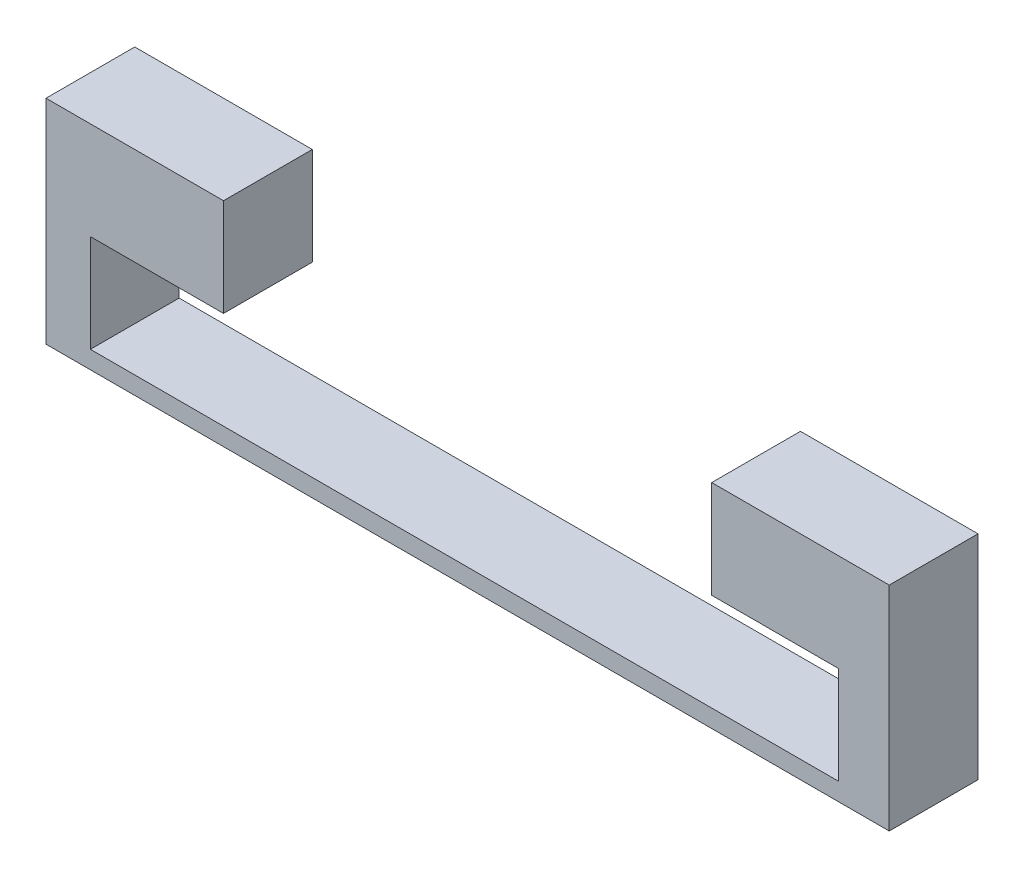
ISO-10303-21;
HEADER;
FILE_DESCRIPTION(('STEP AP214'),'2;1');
FILE_NAME('part.step','',(''),(''),'','','');
FILE_SCHEMA(('AUTOMOTIVE_DESIGN { 1 0 10303 214 1 1 1 1 }'));
ENDSEC;
DATA;
#1=APPLICATION_CONTEXT('core data for automotive mechanical design processes');
#2=APPLICATION_PROTOCOL_DEFINITION('international standard','automotive_design',2000,#1);
#3=PRODUCT_CONTEXT('',#1,'mechanical');
#4=PRODUCT('Part','Part','',(#3));
#5=PRODUCT_RELATED_PRODUCT_CATEGORY('part','',(#4));
#6=PRODUCT_DEFINITION_FORMATION('','',#4);
#7=PRODUCT_DEFINITION_CONTEXT('part definition',#1,'design');
#8=PRODUCT_DEFINITION('design','',#6,#7);
#9=PRODUCT_DEFINITION_SHAPE('','',#8);
#10=(LENGTH_UNIT() NAMED_UNIT(*) SI_UNIT(.MILLI.,.METRE.));
#11=(NAMED_UNIT(*) PLANE_ANGLE_UNIT() SI_UNIT($,.RADIAN.));
#12=(NAMED_UNIT(*) SI_UNIT($,.STERADIAN.) SOLID_ANGLE_UNIT());
#13=UNCERTAINTY_MEASURE_WITH_UNIT(LENGTH_MEASURE(1.E-05),#10,'distance_accuracy_value','');
#14=(GEOMETRIC_REPRESENTATION_CONTEXT(3) GLOBAL_UNCERTAINTY_ASSIGNED_CONTEXT((#13)) GLOBAL_UNIT_ASSIGNED_CONTEXT((#10,
#11,#12)) REPRESENTATION_CONTEXT('',''));
#15=CARTESIAN_POINT('',(0.,0.,0.));
#16=DIRECTION('',(0.,0.,1.));
#17=DIRECTION('',(1.,0.,0.));
#18=AXIS2_PLACEMENT_3D('',#15,#16,#17);
#19=CARTESIAN_POINT('',(0.,4.8,2.));
#20=DIRECTION('',(1.,0.,0.));
#21=DIRECTION('',(0.,1.,0.));
#22=AXIS2_PLACEMENT_3D('',#19,#20,#21);
#23=PLANE('',#22);
#24=DIRECTION('',(0.,-1.,0.));
#25=VECTOR('',#24,1.);
#26=CARTESIAN_POINT('',(0.,4.8,0.));
#27=LINE('',#26,#25);
#28=CARTESIAN_POINT('',(0.,4.8,0.));
#29=VERTEX_POINT('',#28);
#30=CARTESIAN_POINT('',(0.,0.,0.));
#31=VERTEX_POINT('',#30);
#32=EDGE_CURVE('E162',#29,#31,#27,.T.);
#33=ORIENTED_EDGE('',*,*,#32,.T.);
#34=DIRECTION('',(0.,0.,-1.));
#35=VECTOR('',#34,1.);
#36=CARTESIAN_POINT('',(0.,0.,2.));
#37=LINE('',#36,#35);
#38=CARTESIAN_POINT('',(0.,0.,2.));
#39=VERTEX_POINT('',#38);
#40=EDGE_CURVE('E11',#39,#31,#37,.T.);
#41=ORIENTED_EDGE('',*,*,#40,.F.);
#42=DIRECTION('',(0.,-1.,0.));
#43=VECTOR('',#42,1.);
#44=CARTESIAN_POINT('',(0.,4.8,2.));
#45=LINE('',#44,#43);
#46=CARTESIAN_POINT('',(0.,4.8,2.));
#47=VERTEX_POINT('',#46);
#48=EDGE_CURVE('E196',#47,#39,#45,.T.);
#49=ORIENTED_EDGE('',*,*,#48,.F.);
#50=DIRECTION('',(0.,0.,-1.));
#51=VECTOR('',#50,1.);
#52=CARTESIAN_POINT('',(0.,4.8,2.));
#53=LINE('',#52,#51);
#54=EDGE_CURVE('E158',#47,#29,#53,.T.);
#55=ORIENTED_EDGE('',*,*,#54,.T.);
#56=EDGE_LOOP('',(#33,#41,#49,#55));
#57=FACE_BOUND('',#56,.T.);
#58=ADVANCED_FACE('F36',(#57),#23,.F.);
#59=CARTESIAN_POINT('',(0.,0.,2.));
#60=DIRECTION('',(0.,1.,0.));
#61=DIRECTION('',(0.,0.,1.));
#62=AXIS2_PLACEMENT_3D('',#59,#60,#61);
#63=PLANE('',#62);
#64=DIRECTION('',(1.,0.,0.));
#65=VECTOR('',#64,1.);
#66=CARTESIAN_POINT('',(0.,0.,0.));
#67=LINE('',#66,#65);
#68=CARTESIAN_POINT('',(19.,0.,0.));
#69=VERTEX_POINT('',#68);
#70=EDGE_CURVE('E166',#31,#69,#67,.T.);
#71=ORIENTED_EDGE('',*,*,#70,.T.);
#72=DIRECTION('',(0.,0.,-1.));
#73=VECTOR('',#72,1.);
#74=CARTESIAN_POINT('',(19.,0.,2.));
#75=LINE('',#74,#73);
#76=CARTESIAN_POINT('',(19.,0.,2.));
#77=VERTEX_POINT('',#76);
#78=EDGE_CURVE('E45',#77,#69,#75,.T.);
#79=ORIENTED_EDGE('',*,*,#78,.F.);
#80=DIRECTION('',(1.,0.,0.));
#81=VECTOR('',#80,1.);
#82=CARTESIAN_POINT('',(0.,0.,2.));
#83=LINE('',#82,#81);
#84=EDGE_CURVE('E108',#39,#77,#83,.T.);
#85=ORIENTED_EDGE('',*,*,#84,.F.);
#86=ORIENTED_EDGE('',*,*,#40,.T.);
#87=EDGE_LOOP('',(#71,#79,#85,#86));
#88=FACE_BOUND('',#87,.T.);
#89=ADVANCED_FACE('F297',(#88),#63,.F.);
#90=CARTESIAN_POINT('',(19.,0.,2.));
#91=DIRECTION('',(-1.,0.,0.));
#92=DIRECTION('',(0.,0.,1.));
#93=AXIS2_PLACEMENT_3D('',#90,#91,#92);
#94=PLANE('',#93);
#95=DIRECTION('',(0.,1.,0.));
#96=VECTOR('',#95,1.);
#97=CARTESIAN_POINT('',(19.,0.,0.));
#98=LINE('',#97,#96);
#99=CARTESIAN_POINT('',(19.,4.8,0.));
#100=VERTEX_POINT('',#99);
#101=EDGE_CURVE('E169',#69,#100,#98,.T.);
#102=ORIENTED_EDGE('',*,*,#101,.T.);
#103=DIRECTION('',(0.,0.,-1.));
#104=VECTOR('',#103,1.);
#105=CARTESIAN_POINT('',(19.,4.8,2.));
#106=LINE('',#105,#104);
#107=CARTESIAN_POINT('',(19.,4.8,2.));
#108=VERTEX_POINT('',#107);
#109=EDGE_CURVE('E223',#108,#100,#106,.T.);
#110=ORIENTED_EDGE('',*,*,#109,.F.);
#111=DIRECTION('',(0.,1.,0.));
#112=VECTOR('',#111,1.);
#113=CARTESIAN_POINT('',(19.,0.,2.));
#114=LINE('',#113,#112);
#115=EDGE_CURVE('E234',#77,#108,#114,.T.);
#116=ORIENTED_EDGE('',*,*,#115,.F.);
#117=ORIENTED_EDGE('',*,*,#78,.T.);
#118=EDGE_LOOP('',(#102,#110,#116,#117));
#119=FACE_BOUND('',#118,.T.);
#120=ADVANCED_FACE('F232',(#119),#94,.F.);
#121=CARTESIAN_POINT('',(19.,4.8,2.));
#122=DIRECTION('',(0.,-1.,0.));
#123=DIRECTION('',(1.,0.,0.));
#124=AXIS2_PLACEMENT_3D('',#121,#122,#123);
#125=PLANE('',#124);
#126=DIRECTION('',(-1.,0.,0.));
#127=VECTOR('',#126,1.);
#128=CARTESIAN_POINT('',(19.,4.8,0.));
#129=LINE('',#128,#127);
#130=CARTESIAN_POINT('',(15.,4.8,0.));
#131=VERTEX_POINT('',#130);
#132=EDGE_CURVE('E172',#100,#131,#129,.T.);
#133=ORIENTED_EDGE('',*,*,#132,.T.);
#134=DIRECTION('',(0.,0.,-1.));
#135=VECTOR('',#134,1.);
#136=CARTESIAN_POINT('',(15.,4.8,2.));
#137=LINE('',#136,#135);
#138=CARTESIAN_POINT('',(15.,4.8,2.));
#139=VERTEX_POINT('',#138);
#140=EDGE_CURVE('E219',#139,#131,#137,.T.);
#141=ORIENTED_EDGE('',*,*,#140,.F.);
#142=DIRECTION('',(-1.,0.,0.));
#143=VECTOR('',#142,1.);
#144=CARTESIAN_POINT('',(19.,4.8,2.));
#145=LINE('',#144,#143);
#146=EDGE_CURVE('E253',#108,#139,#145,.T.);
#147=ORIENTED_EDGE('',*,*,#146,.F.);
#148=ORIENTED_EDGE('',*,*,#109,.T.);
#149=EDGE_LOOP('',(#133,#141,#147,#148));
#150=FACE_BOUND('',#149,.T.);
#151=ADVANCED_FACE('F243',(#150),#125,.F.);
#152=CARTESIAN_POINT('',(15.,4.8,2.));
#153=DIRECTION('',(1.,0.,0.));
#154=DIRECTION('',(0.,0.,-1.));
#155=AXIS2_PLACEMENT_3D('',#152,#153,#154);
#156=PLANE('',#155);
#157=DIRECTION('',(0.,-1.,0.));
#158=VECTOR('',#157,1.);
#159=CARTESIAN_POINT('',(15.,4.8,0.));
#160=LINE('',#159,#158);
#161=CARTESIAN_POINT('',(15.,2.6,0.));
#162=VERTEX_POINT('',#161);
#163=EDGE_CURVE('E175',#131,#162,#160,.T.);
#164=ORIENTED_EDGE('',*,*,#163,.T.);
#165=DIRECTION('',(0.,0.,-1.));
#166=VECTOR('',#165,1.);
#167=CARTESIAN_POINT('',(15.,2.6,1.99999999999996));
#168=LINE('',#167,#166);
#169=CARTESIAN_POINT('',(15.,2.6,1.99999999999996));
#170=VERTEX_POINT('',#169);
#171=EDGE_CURVE('E215',#170,#162,#168,.T.);
#172=ORIENTED_EDGE('',*,*,#171,.F.);
#173=DIRECTION('',(0.,-1.,0.));
#174=VECTOR('',#173,1.);
#175=CARTESIAN_POINT('',(15.,4.8,2.));
#176=LINE('',#175,#174);
#177=EDGE_CURVE('E249',#139,#170,#176,.T.);
#178=ORIENTED_EDGE('',*,*,#177,.F.);
#179=ORIENTED_EDGE('',*,*,#140,.T.);
#180=EDGE_LOOP('',(#164,#172,#178,#179));
#181=FACE_BOUND('',#180,.T.);
#182=ADVANCED_FACE('F247',(#181),#156,.F.);
#183=CARTESIAN_POINT('',(15.,2.6,1.99999999999996));
#184=DIRECTION('',(0.,1.,0.));
#185=DIRECTION('',(0.,0.,1.));
#186=AXIS2_PLACEMENT_3D('',#183,#184,#185);
#187=PLANE('',#186);
#188=DIRECTION('',(1.,0.,0.));
#189=VECTOR('',#188,1.);
#190=CARTESIAN_POINT('',(15.,2.6,0.));
#191=LINE('',#190,#189);
#192=CARTESIAN_POINT('',(17.8556430446194,2.6,0.));
#193=VERTEX_POINT('',#192);
#194=EDGE_CURVE('E178',#162,#193,#191,.T.);
#195=ORIENTED_EDGE('',*,*,#194,.T.);
#196=DIRECTION('',(0.,0.,-1.));
#197=VECTOR('',#196,1.);
#198=CARTESIAN_POINT('',(17.8556430446194,2.6,1.99999999999996));
#199=LINE('',#198,#197);
#200=CARTESIAN_POINT('',(17.8556430446194,2.6,1.99999999999996));
#201=VERTEX_POINT('',#200);
#202=EDGE_CURVE('E211',#201,#193,#199,.T.);
#203=ORIENTED_EDGE('',*,*,#202,.F.);
#204=DIRECTION('',(1.,0.,0.));
#205=VECTOR('',#204,1.);
#206=CARTESIAN_POINT('',(15.,2.6,1.99999999999996));
#207=LINE('',#206,#205);
#208=EDGE_CURVE('E252',#170,#201,#207,.T.);
#209=ORIENTED_EDGE('',*,*,#208,.F.);
#210=ORIENTED_EDGE('',*,*,#171,.T.);
#211=EDGE_LOOP('',(#195,#203,#209,#210));
#212=FACE_BOUND('',#211,.T.);
#213=ADVANCED_FACE('F310',(#212),#187,.F.);
#214=CARTESIAN_POINT('',(17.8556430446194,2.6,1.99999999999996));
#215=DIRECTION('',(1.,0.,0.));
#216=DIRECTION('',(0.,0.,-1.));
#217=AXIS2_PLACEMENT_3D('',#214,#215,#216);
#218=PLANE('',#217);
#219=DIRECTION('',(0.,-1.,0.));
#220=VECTOR('',#219,1.);
#221=CARTESIAN_POINT('',(17.8556430446194,2.6,0.));
#222=LINE('',#221,#220);
#223=CARTESIAN_POINT('',(17.8556430446194,0.400000000000001,0.));
#224=VERTEX_POINT('',#223);
#225=EDGE_CURVE('E181',#193,#224,#222,.T.);
#226=ORIENTED_EDGE('',*,*,#225,.T.);
#227=DIRECTION('',(0.,0.,-1.));
#228=VECTOR('',#227,1.);
#229=CARTESIAN_POINT('',(17.8556430446194,0.400000000000001,2.));
#230=LINE('',#229,#228);
#231=CARTESIAN_POINT('',(17.8556430446194,0.400000000000001,2.));
#232=VERTEX_POINT('',#231);
#233=EDGE_CURVE('E207',#232,#224,#230,.T.);
#234=ORIENTED_EDGE('',*,*,#233,.F.);
#235=DIRECTION('',(0.,-1.,0.));
#236=VECTOR('',#235,1.);
#237=CARTESIAN_POINT('',(17.8556430446194,2.6,1.99999999999996));
#238=LINE('',#237,#236);
#239=EDGE_CURVE('E258',#201,#232,#238,.T.);
#240=ORIENTED_EDGE('',*,*,#239,.F.);
#241=ORIENTED_EDGE('',*,*,#202,.T.);
#242=EDGE_LOOP('',(#226,#234,#240,#241));
#243=FACE_BOUND('',#242,.T.);
#244=ADVANCED_FACE('F313',(#243),#218,.F.);
#245=CARTESIAN_POINT('',(1.,0.400000000000001,2.));
#246=DIRECTION('',(0.,-1.,0.));
#247=DIRECTION('',(0.,0.,-1.));
#248=AXIS2_PLACEMENT_3D('',#245,#246,#247);
#249=PLANE('',#248);
#250=DIRECTION('',(-1.,0.,0.));
#251=VECTOR('',#250,1.);
#252=CARTESIAN_POINT('',(1.,0.400000000000001,0.));
#253=LINE('',#252,#251);
#254=CARTESIAN_POINT('',(1.,0.400000000000001,0.));
#255=VERTEX_POINT('',#254);
#256=EDGE_CURVE('E184',#224,#255,#253,.T.);
#257=ORIENTED_EDGE('',*,*,#256,.T.);
#258=DIRECTION('',(0.,0.,-1.));
#259=VECTOR('',#258,1.);
#260=CARTESIAN_POINT('',(1.,0.400000000000001,2.));
#261=LINE('',#260,#259);
#262=CARTESIAN_POINT('',(1.,0.400000000000001,2.));
#263=VERTEX_POINT('',#262);
#264=EDGE_CURVE('E203',#263,#255,#261,.T.);
#265=ORIENTED_EDGE('',*,*,#264,.F.);
#266=DIRECTION('',(-1.,0.,0.));
#267=VECTOR('',#266,1.);
#268=CARTESIAN_POINT('',(1.,0.400000000000001,2.));
#269=LINE('',#268,#267);
#270=EDGE_CURVE('E265',#232,#263,#269,.T.);
#271=ORIENTED_EDGE('',*,*,#270,.F.);
#272=ORIENTED_EDGE('',*,*,#233,.T.);
#273=EDGE_LOOP('',(#257,#265,#271,#272));
#274=FACE_BOUND('',#273,.T.);
#275=ADVANCED_FACE('F278',(#274),#249,.F.);
#276=CARTESIAN_POINT('',(1.,0.400000000000001,2.));
#277=DIRECTION('',(-1.,0.,0.));
#278=DIRECTION('',(0.,0.,1.));
#279=AXIS2_PLACEMENT_3D('',#276,#277,#278);
#280=PLANE('',#279);
#281=DIRECTION('',(0.,1.,0.));
#282=VECTOR('',#281,1.);
#283=CARTESIAN_POINT('',(1.,0.400000000000001,0.));
#284=LINE('',#283,#282);
#285=CARTESIAN_POINT('',(1.,2.6,0.));
#286=VERTEX_POINT('',#285);
#287=EDGE_CURVE('E187',#255,#286,#284,.T.);
#288=ORIENTED_EDGE('',*,*,#287,.T.);
#289=DIRECTION('',(0.,0.,-1.));
#290=VECTOR('',#289,1.);
#291=CARTESIAN_POINT('',(1.,2.6,1.99999999999996));
#292=LINE('',#291,#290);
#293=CARTESIAN_POINT('',(1.,2.6,1.99999999999996));
#294=VERTEX_POINT('',#293);
#295=EDGE_CURVE('E150',#294,#286,#292,.T.);
#296=ORIENTED_EDGE('',*,*,#295,.F.);
#297=DIRECTION('',(0.,1.,0.));
#298=VECTOR('',#297,1.);
#299=CARTESIAN_POINT('',(1.,0.400000000000001,2.));
#300=LINE('',#299,#298);
#301=EDGE_CURVE('E139',#263,#294,#300,.T.);
#302=ORIENTED_EDGE('',*,*,#301,.F.);
#303=ORIENTED_EDGE('',*,*,#264,.T.);
#304=EDGE_LOOP('',(#288,#296,#302,#303));
#305=FACE_BOUND('',#304,.T.);
#306=ADVANCED_FACE('F282',(#305),#280,.F.);
#307=CARTESIAN_POINT('',(1.,2.6,1.99999999999996));
#308=DIRECTION('',(0.,1.,0.));
#309=DIRECTION('',(0.,0.,1.));
#310=AXIS2_PLACEMENT_3D('',#307,#308,#309);
#311=PLANE('',#310);
#312=DIRECTION('',(1.,0.,0.));
#313=VECTOR('',#312,1.);
#314=CARTESIAN_POINT('',(1.,2.6,0.));
#315=LINE('',#314,#313);
#316=CARTESIAN_POINT('',(4.,2.6,0.));
#317=VERTEX_POINT('',#316);
#318=EDGE_CURVE('E148',#286,#317,#315,.T.);
#319=ORIENTED_EDGE('',*,*,#318,.T.);
#320=DIRECTION('',(0.,0.,-1.));
#321=VECTOR('',#320,1.);
#322=CARTESIAN_POINT('',(4.,2.6,1.99999999999996));
#323=LINE('',#322,#321);
#324=CARTESIAN_POINT('',(4.,2.6,1.99999999999996));
#325=VERTEX_POINT('',#324);
#326=EDGE_CURVE('E145',#325,#317,#323,.T.);
#327=ORIENTED_EDGE('',*,*,#326,.F.);
#328=DIRECTION('',(1.,0.,0.));
#329=VECTOR('',#328,1.);
#330=CARTESIAN_POINT('',(1.,2.6,1.99999999999996));
#331=LINE('',#330,#329);
#332=EDGE_CURVE('E133',#294,#325,#331,.T.);
#333=ORIENTED_EDGE('',*,*,#332,.F.);
#334=ORIENTED_EDGE('',*,*,#295,.T.);
#335=EDGE_LOOP('',(#319,#327,#333,#334));
#336=FACE_BOUND('',#335,.T.);
#337=ADVANCED_FACE('F146',(#336),#311,.F.);
#338=CARTESIAN_POINT('',(4.,2.6,1.99999999999996));
#339=DIRECTION('',(-1.,0.,0.));
#340=DIRECTION('',(0.,0.,1.));
#341=AXIS2_PLACEMENT_3D('',#338,#339,#340);
#342=PLANE('',#341);
#343=DIRECTION('',(0.,1.,0.));
#344=VECTOR('',#343,1.);
#345=CARTESIAN_POINT('',(4.,2.6,0.));
#346=LINE('',#345,#344);
#347=CARTESIAN_POINT('',(4.,4.8,0.));
#348=VERTEX_POINT('',#347);
#349=EDGE_CURVE('E94',#317,#348,#346,.T.);
#350=ORIENTED_EDGE('',*,*,#349,.T.);
#351=DIRECTION('',(0.,0.,-1.));
#352=VECTOR('',#351,1.);
#353=CARTESIAN_POINT('',(4.,4.8,2.));
#354=LINE('',#353,#352);
#355=CARTESIAN_POINT('',(4.,4.8,2.));
#356=VERTEX_POINT('',#355);
#357=EDGE_CURVE('E151',#356,#348,#354,.T.);
#358=ORIENTED_EDGE('',*,*,#357,.F.);
#359=DIRECTION('',(0.,1.,0.));
#360=VECTOR('',#359,1.);
#361=CARTESIAN_POINT('',(4.,2.6,1.99999999999996));
#362=LINE('',#361,#360);
#363=EDGE_CURVE('E137',#325,#356,#362,.T.);
#364=ORIENTED_EDGE('',*,*,#363,.F.);
#365=ORIENTED_EDGE('',*,*,#326,.T.);
#366=EDGE_LOOP('',(#350,#358,#364,#365));
#367=FACE_BOUND('',#366,.T.);
#368=ADVANCED_FACE('F153',(#367),#342,.F.);
#369=CARTESIAN_POINT('',(4.,4.8,2.));
#370=DIRECTION('',(0.,-1.,0.));
#371=DIRECTION('',(1.,0.,0.));
#372=AXIS2_PLACEMENT_3D('',#369,#370,#371);
#373=PLANE('',#372);
#374=DIRECTION('',(-1.,0.,0.));
#375=VECTOR('',#374,1.);
#376=CARTESIAN_POINT('',(4.,4.8,0.));
#377=LINE('',#376,#375);
#378=EDGE_CURVE('E100',#348,#29,#377,.T.);
#379=ORIENTED_EDGE('',*,*,#378,.T.);
#380=ORIENTED_EDGE('',*,*,#54,.F.);
#381=DIRECTION('',(-1.,0.,0.));
#382=VECTOR('',#381,1.);
#383=CARTESIAN_POINT('',(4.,4.8,2.));
#384=LINE('',#383,#382);
#385=EDGE_CURVE('E53',#356,#47,#384,.T.);
#386=ORIENTED_EDGE('',*,*,#385,.F.);
#387=ORIENTED_EDGE('',*,*,#357,.T.);
#388=EDGE_LOOP('',(#379,#380,#386,#387));
#389=FACE_BOUND('',#388,.T.);
#390=ADVANCED_FACE('F286',(#389),#373,.F.);
#391=CARTESIAN_POINT('',(0.,0.,2.));
#392=DIRECTION('',(0.,0.,1.));
#393=DIRECTION('',(1.,0.,0.));
#394=AXIS2_PLACEMENT_3D('',#391,#392,#393);
#395=PLANE('',#394);
#396=ORIENTED_EDGE('',*,*,#48,.T.);
#397=ORIENTED_EDGE('',*,*,#84,.T.);
#398=ORIENTED_EDGE('',*,*,#115,.T.);
#399=ORIENTED_EDGE('',*,*,#146,.T.);
#400=ORIENTED_EDGE('',*,*,#177,.T.);
#401=ORIENTED_EDGE('',*,*,#208,.T.);
#402=ORIENTED_EDGE('',*,*,#239,.T.);
#403=ORIENTED_EDGE('',*,*,#270,.T.);
#404=ORIENTED_EDGE('',*,*,#301,.T.);
#405=ORIENTED_EDGE('',*,*,#332,.T.);
#406=ORIENTED_EDGE('',*,*,#363,.T.);
#407=ORIENTED_EDGE('',*,*,#385,.T.);
#408=EDGE_LOOP('',(#396,#397,#398,#399,#400,#401,#402,#403,#404,#405,#406,#407));
#409=FACE_BOUND('',#408,.T.);
#410=ADVANCED_FACE('F135',(#409),#395,.T.);
#411=CARTESIAN_POINT('',(0.,0.,0.));
#412=DIRECTION('',(0.,0.,1.));
#413=DIRECTION('',(1.,0.,0.));
#414=AXIS2_PLACEMENT_3D('',#411,#412,#413);
#415=PLANE('',#414);
#416=ORIENTED_EDGE('',*,*,#32,.F.);
#417=ORIENTED_EDGE('',*,*,#378,.F.);
#418=ORIENTED_EDGE('',*,*,#349,.F.);
#419=ORIENTED_EDGE('',*,*,#318,.F.);
#420=ORIENTED_EDGE('',*,*,#287,.F.);
#421=ORIENTED_EDGE('',*,*,#256,.F.);
#422=ORIENTED_EDGE('',*,*,#225,.F.);
#423=ORIENTED_EDGE('',*,*,#194,.F.);
#424=ORIENTED_EDGE('',*,*,#163,.F.);
#425=ORIENTED_EDGE('',*,*,#132,.F.);
#426=ORIENTED_EDGE('',*,*,#101,.F.);
#427=ORIENTED_EDGE('',*,*,#70,.F.);
#428=EDGE_LOOP('',(#416,#417,#418,#419,#420,#421,#422,#423,#424,#425,#426,#427));
#429=FACE_BOUND('',#428,.T.);
#430=ADVANCED_FACE('F238',(#429),#415,.F.);
#431=CLOSED_SHELL('',(#58,#89,#120,#151,#182,#213,#244,#275,#306,#337,#368,#390,#410,#430));
#432=MANIFOLD_SOLID_BREP('B2',#431);
#433=ADVANCED_BREP_SHAPE_REPRESENTATION('',(#18,#432),#14);
#434=SHAPE_DEFINITION_REPRESENTATION(#9,#433);
ENDSEC;
END-ISO-10303-21;
